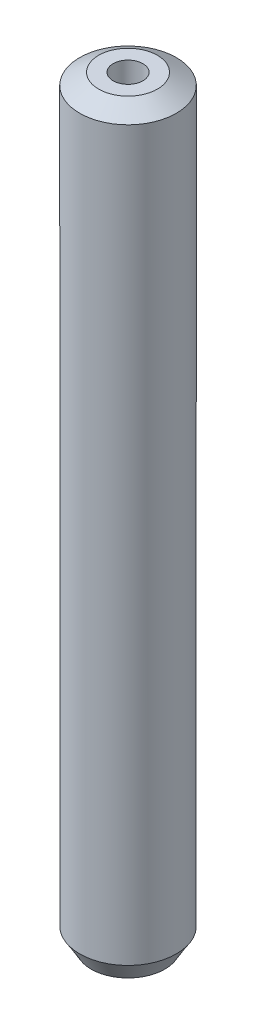
ISO-10303-21;
HEADER;
FILE_DESCRIPTION(('STEP AP214'),'2;1');
FILE_NAME('part.step','',(''),(''),'','','');
FILE_SCHEMA(('AUTOMOTIVE_DESIGN { 1 0 10303 214 1 1 1 1 }'));
ENDSEC;
DATA;
#1=APPLICATION_CONTEXT('core data for automotive mechanical design processes');
#2=APPLICATION_PROTOCOL_DEFINITION('international standard','automotive_design',2000,#1);
#3=PRODUCT_CONTEXT('',#1,'mechanical');
#4=PRODUCT('Part','Part','',(#3));
#5=PRODUCT_RELATED_PRODUCT_CATEGORY('part','',(#4));
#6=PRODUCT_DEFINITION_FORMATION('','',#4);
#7=PRODUCT_DEFINITION_CONTEXT('part definition',#1,'design');
#8=PRODUCT_DEFINITION('design','',#6,#7);
#9=PRODUCT_DEFINITION_SHAPE('','',#8);
#10=(LENGTH_UNIT() NAMED_UNIT(*) SI_UNIT(.MILLI.,.METRE.));
#11=(NAMED_UNIT(*) PLANE_ANGLE_UNIT() SI_UNIT($,.RADIAN.));
#12=(NAMED_UNIT(*) SI_UNIT($,.STERADIAN.) SOLID_ANGLE_UNIT());
#13=UNCERTAINTY_MEASURE_WITH_UNIT(LENGTH_MEASURE(1.E-05),#10,'distance_accuracy_value','');
#14=(GEOMETRIC_REPRESENTATION_CONTEXT(3) GLOBAL_UNCERTAINTY_ASSIGNED_CONTEXT((#13)) GLOBAL_UNIT_ASSIGNED_CONTEXT((#10,
#11,#12)) REPRESENTATION_CONTEXT('',''));
#15=CARTESIAN_POINT('',(0.,0.,0.));
#16=DIRECTION('',(0.,0.,1.));
#17=DIRECTION('',(1.,0.,0.));
#18=AXIS2_PLACEMENT_3D('',#15,#16,#17);
#19=CARTESIAN_POINT('',(0.,157.006909282694,0.));
#20=DIRECTION('',(0.,-1.,0.));
#21=DIRECTION('',(0.,0.,-1.));
#22=AXIS2_PLACEMENT_3D('',#19,#20,#21);
#23=CYLINDRICAL_SURFACE('',#22,10.);
#24=CARTESIAN_POINT('',(0.,154.643035266807,0.));
#25=DIRECTION('',(0.,1.,0.));
#26=DIRECTION('',(0.,0.,1.));
#27=AXIS2_PLACEMENT_3D('',#24,#25,#26);
#28=CIRCLE('',#27,10.);
#29=CARTESIAN_POINT('',(0.,154.643035266807,-10.));
#30=VERTEX_POINT('',#29);
#31=EDGE_CURVE('E50',#30,#30,#28,.F.);
#32=CARTESIAN_POINT('',(0.,3.92537237837895,0.));
#33=DIRECTION('',(0.,1.,0.));
#34=DIRECTION('',(0.,0.,1.));
#35=AXIS2_PLACEMENT_3D('',#32,#33,#34);
#36=CIRCLE('',#35,10.);
#37=CARTESIAN_POINT('',(0.,3.92537237837892,-10.));
#38=VERTEX_POINT('',#37);
#39=EDGE_CURVE('E51',#38,#38,#36,.T.);
#40=CARTESIAN_POINT('',(0.,154.643035266807,-10.));
#41=CARTESIAN_POINT('',(0.,153.073059611719,-10.));
#42=CARTESIAN_POINT('',(0.,151.503083956631,-10.));
#43=CARTESIAN_POINT('',(0.,148.363132646456,-10.));
#44=CARTESIAN_POINT('',(0.,146.793156991368,-10.));
#45=CARTESIAN_POINT('',(0.,143.653205681193,-10.));
#46=CARTESIAN_POINT('',(0.,142.083230026105,-10.));
#47=CARTESIAN_POINT('',(0.,138.943278715929,-10.));
#48=CARTESIAN_POINT('',(0.,137.373303060841,-10.));
#49=CARTESIAN_POINT('',(0.,134.233351750666,-10.));
#50=CARTESIAN_POINT('',(0.,132.663376095578,-10.));
#51=CARTESIAN_POINT('',(0.,129.523424785402,-10.));
#52=CARTESIAN_POINT('',(0.,127.953449130315,-10.));
#53=CARTESIAN_POINT('',(0.,124.813497820139,-10.));
#54=CARTESIAN_POINT('',(0.,123.243522165051,-10.));
#55=CARTESIAN_POINT('',(0.,120.103570854876,-10.));
#56=CARTESIAN_POINT('',(0.,118.533595199788,-10.));
#57=CARTESIAN_POINT('',(0.,115.393643889612,-10.));
#58=CARTESIAN_POINT('',(0.,113.823668234524,-10.));
#59=CARTESIAN_POINT('',(0.,110.683716924349,-10.));
#60=CARTESIAN_POINT('',(0.,109.113741269261,-10.));
#61=CARTESIAN_POINT('',(0.,105.973789959085,-10.));
#62=CARTESIAN_POINT('',(0.,104.403814303998,-10.));
#63=CARTESIAN_POINT('',(0.,101.263862993822,-10.));
#64=CARTESIAN_POINT('',(0.,99.6938873387343,-10.));
#65=CARTESIAN_POINT('',(0.,96.5539360285587,-10.));
#66=CARTESIAN_POINT('',(0.,94.9839603734709,-10.));
#67=CARTESIAN_POINT('',(0.,91.8440090632953,-10.));
#68=CARTESIAN_POINT('',(0.,90.2740334082075,-10.));
#69=CARTESIAN_POINT('',(0.,87.134082098032,-10.));
#70=CARTESIAN_POINT('',(0.,85.5641064429442,-10.));
#71=CARTESIAN_POINT('',(0.,82.4241551327686,-10.));
#72=CARTESIAN_POINT('',(0.,80.8541794776808,-10.));
#73=CARTESIAN_POINT('',(0.,77.7142281675052,-10.));
#74=CARTESIAN_POINT('',(0.,76.1442525124174,-10.));
#75=CARTESIAN_POINT('',(0.,73.0043012022418,-10.));
#76=CARTESIAN_POINT('',(0.,71.434325547154,-10.));
#77=CARTESIAN_POINT('',(0.,68.2943742369784,-10.));
#78=CARTESIAN_POINT('',(0.,66.7243985818906,-10.));
#79=CARTESIAN_POINT('',(0.,63.5844472717151,-10.));
#80=CARTESIAN_POINT('',(0.,62.0144716166273,-10.));
#81=CARTESIAN_POINT('',(0.,58.8745203064517,-10.));
#82=CARTESIAN_POINT('',(0.,57.3045446513639,-10.));
#83=CARTESIAN_POINT('',(0.,54.1645933411883,-10.));
#84=CARTESIAN_POINT('',(0.,52.5946176861005,-10.));
#85=CARTESIAN_POINT('',(0.,49.4546663759249,-10.));
#86=CARTESIAN_POINT('',(0.,47.8846907208371,-10.));
#87=CARTESIAN_POINT('',(0.,44.7447394106615,-10.));
#88=CARTESIAN_POINT('',(0.,43.1747637555737,-10.));
#89=CARTESIAN_POINT('',(0.,40.0348124453981,-10.));
#90=CARTESIAN_POINT('',(0.,38.4648367903104,-10.));
#91=CARTESIAN_POINT('',(0.,35.3248854801348,-10.));
#92=CARTESIAN_POINT('',(0.,33.754909825047,-10.));
#93=CARTESIAN_POINT('',(0.,30.6149585148714,-10.));
#94=CARTESIAN_POINT('',(0.,29.0449828597836,-10.));
#95=CARTESIAN_POINT('',(0.,25.905031549608,-10.));
#96=CARTESIAN_POINT('',(0.,24.3350558945202,-10.));
#97=CARTESIAN_POINT('',(0.,21.1951045843446,-10.));
#98=CARTESIAN_POINT('',(0.,19.6251289292568,-10.));
#99=CARTESIAN_POINT('',(0.,16.4851776190813,-10.));
#100=CARTESIAN_POINT('',(0.,14.9152019639935,-10.));
#101=CARTESIAN_POINT('',(0.,11.7752506538179,-10.));
#102=CARTESIAN_POINT('',(0.,10.2052749987301,-10.));
#103=CARTESIAN_POINT('',(0.,7.06532368855448,-10.));
#104=CARTESIAN_POINT('',(0.,5.4953480334667,-10.));
#105=CARTESIAN_POINT('',(0.,3.92537237837892,-10.));
#106=B_SPLINE_CURVE_WITH_KNOTS('',3,(#40,#41,#42,#43,#44,#45,#46,#47,#48,#49,#50,#51,#52,#53,
#54,#55,#56,#57,#58,#59,#60,#61,#62,#63,#64,#65,#66,#67,#68,#69,#70,#71,#72,#73,#74,#75,#76,#77,
#78,#79,#80,#81,#82,#83,#84,#85,#86,#87,#88,#89,#90,#91,#92,#93,#94,#95,#96,#97,#98,#99,#100,
#101,#102,#103,#104,#105),.UNSPECIFIED.,.F.,.F.,(4,2,2,2,2,2,2,2,2,2,2,2,2,2,2,2,2,2,2,2,2,2,2,
2,2,2,2,2,2,2,2,2,4),(0.,4.7099269652634,9.41985393052677,14.1297808957901,18.8397078610535,
23.5496348263169,28.2595617915803,32.9694887568437,37.6794157221071,42.3893426873704,
47.0992696526338,51.8091966178972,56.5191235831606,61.2290505484239,65.9389775136873,
70.6489044789507,75.3588314442141,80.0687584094775,84.7786853747409,89.4886123400042,
94.1985393052676,98.908466270531,103.618393235794,108.328320201058,113.038247166321,
117.748174131585,122.458101096848,127.168028062111,131.877955027375,136.587881992638,
141.297808957901,146.007735923165,150.717662888428),.UNSPECIFIED.);
#107=EDGE_CURVE('BSEAM39',#30,#38,#106,.T.);
#108=ORIENTED_EDGE('',*,*,#31,.T.);
#109=ORIENTED_EDGE('',*,*,#39,.T.);
#110=ORIENTED_EDGE('',*,*,#107,.T.);
#111=ORIENTED_EDGE('',*,*,#107,.F.);
#112=EDGE_LOOP('',(#108,#110,#109,#111));
#113=FACE_BOUND('',#112,.T.);
#114=ADVANCED_FACE('F39',(#113),#23,.T.);
#115=CARTESIAN_POINT('',(0.,157.006909282694,0.));
#116=DIRECTION('',(0.,1.,0.));
#117=DIRECTION('',(0.,0.,1.));
#118=AXIS2_PLACEMENT_3D('',#115,#116,#117);
#119=PLANE('',#118);
#120=CARTESIAN_POINT('',(0.,157.006909282694,0.));
#121=DIRECTION('',(0.,1.,0.));
#122=DIRECTION('',(0.,0.,1.));
#123=AXIS2_PLACEMENT_3D('',#120,#121,#122);
#124=CIRCLE('',#123,6.07462762162128);
#125=CARTESIAN_POINT('',(0.,157.006909282694,6.07462762162128));
#126=VERTEX_POINT('',#125);
#127=EDGE_CURVE('E54',#126,#126,#124,.T.);
#128=ORIENTED_EDGE('',*,*,#127,.T.);
#129=EDGE_LOOP('',(#128));
#130=FACE_BOUND('',#129,.T.);
#131=CARTESIAN_POINT('',(0.,157.006909282694,0.));
#132=DIRECTION('',(0.,1.,0.));
#133=DIRECTION('',(0.,0.,1.));
#134=AXIS2_PLACEMENT_3D('',#131,#132,#133);
#135=CIRCLE('',#134,3.08201990354724);
#136=CARTESIAN_POINT('',(0.,157.006909282694,-3.08201990354724));
#137=VERTEX_POINT('',#136);
#138=EDGE_CURVE('E58',#137,#137,#135,.T.);
#139=ORIENTED_EDGE('',*,*,#138,.F.);
#140=EDGE_LOOP('',(#139));
#141=FACE_BOUND('',#140,.T.);
#142=ADVANCED_FACE('F69',(#130,#141),#119,.T.);
#143=CARTESIAN_POINT('',(0.,0.,0.));
#144=DIRECTION('',(0.,1.,0.));
#145=DIRECTION('',(0.,0.,1.));
#146=AXIS2_PLACEMENT_3D('',#143,#144,#145);
#147=PLANE('',#146);
#148=CARTESIAN_POINT('',(0.,0.,0.));
#149=DIRECTION('',(0.,1.,0.));
#150=DIRECTION('',(0.,0.,1.));
#151=AXIS2_PLACEMENT_3D('',#148,#149,#150);
#152=CIRCLE('',#151,7.63612598411303);
#153=CARTESIAN_POINT('',(0.,0.,7.63612598411303));
#154=VERTEX_POINT('',#153);
#155=EDGE_CURVE('E10',#154,#154,#152,.F.);
#156=ORIENTED_EDGE('',*,*,#155,.T.);
#157=EDGE_LOOP('',(#156));
#158=FACE_BOUND('',#157,.T.);
#159=CARTESIAN_POINT('',(0.,0.,0.));
#160=DIRECTION('',(0.,1.,0.));
#161=DIRECTION('',(0.,0.,1.));
#162=AXIS2_PLACEMENT_3D('',#159,#160,#161);
#163=CIRCLE('',#162,3.08201990354724);
#164=CARTESIAN_POINT('',(0.,0.,-3.08201990354724));
#165=VERTEX_POINT('',#164);
#166=EDGE_CURVE('E63',#165,#165,#163,.T.);
#167=ORIENTED_EDGE('',*,*,#166,.T.);
#168=EDGE_LOOP('',(#167));
#169=FACE_BOUND('',#168,.T.);
#170=ADVANCED_FACE('F75',(#158,#169),#147,.F.);
#171=CARTESIAN_POINT('',(0.,157.006909282694,0.));
#172=DIRECTION('',(0.,-1.,0.));
#173=DIRECTION('',(0.,0.,-1.));
#174=AXIS2_PLACEMENT_3D('',#171,#172,#173);
#175=CYLINDRICAL_SURFACE('',#174,3.08201990354724);
#176=CARTESIAN_POINT('',(0.,157.006909282694,-3.08201990354724));
#177=CARTESIAN_POINT('',(0.,155.371420644333,-3.08201990354724));
#178=CARTESIAN_POINT('',(0.,153.735932005971,-3.08201990354724));
#179=CARTESIAN_POINT('',(0.,150.464954729248,-3.08201990354724));
#180=CARTESIAN_POINT('',(0.,148.829466090887,-3.08201990354724));
#181=CARTESIAN_POINT('',(0.,145.558488814164,-3.08201990354724));
#182=CARTESIAN_POINT('',(0.,143.923000175803,-3.08201990354724));
#183=CARTESIAN_POINT('',(0.,140.65202289908,-3.08201990354724));
#184=CARTESIAN_POINT('',(0.,139.016534260719,-3.08201990354724));
#185=CARTESIAN_POINT('',(0.,135.745556983996,-3.08201990354724));
#186=CARTESIAN_POINT('',(0.,134.110068345634,-3.08201990354724));
#187=CARTESIAN_POINT('',(0.,130.839091068912,-3.08201990354724));
#188=CARTESIAN_POINT('',(0.,129.20360243055,-3.08201990354724));
#189=CARTESIAN_POINT('',(0.,125.932625153827,-3.08201990354724));
#190=CARTESIAN_POINT('',(0.,124.297136515466,-3.08201990354724));
#191=CARTESIAN_POINT('',(0.,121.026159238743,-3.08201990354724));
#192=CARTESIAN_POINT('',(0.,119.390670600382,-3.08201990354724));
#193=CARTESIAN_POINT('',(0.,116.119693323659,-3.08201990354724));
#194=CARTESIAN_POINT('',(0.,114.484204685298,-3.08201990354724));
#195=CARTESIAN_POINT('',(0.,111.213227408575,-3.08201990354724));
#196=CARTESIAN_POINT('',(0.,109.577738770213,-3.08201990354724));
#197=CARTESIAN_POINT('',(0.,106.306761493491,-3.08201990354724));
#198=CARTESIAN_POINT('',(0.,104.671272855129,-3.08201990354724));
#199=CARTESIAN_POINT('',(0.,101.400295578406,-3.08201990354724));
#200=CARTESIAN_POINT('',(0.,99.7648069400451,-3.08201990354724));
#201=CARTESIAN_POINT('',(0.,96.4938296633223,-3.08201990354724));
#202=CARTESIAN_POINT('',(0.,94.8583410249609,-3.08201990354724));
#203=CARTESIAN_POINT('',(0.,91.5873637482381,-3.08201990354724));
#204=CARTESIAN_POINT('',(0.,89.9518751098767,-3.08201990354724));
#205=CARTESIAN_POINT('',(0.,86.6808978331539,-3.08201990354724));
#206=CARTESIAN_POINT('',(0.,85.0454091947925,-3.08201990354724));
#207=CARTESIAN_POINT('',(0.,81.7744319180698,-3.08201990354724));
#208=CARTESIAN_POINT('',(0.,80.1389432797084,-3.08201990354724));
#209=CARTESIAN_POINT('',(0.,76.8679660029856,-3.08201990354724));
#210=CARTESIAN_POINT('',(0.,75.2324773646242,-3.08201990354724));
#211=CARTESIAN_POINT('',(0.,71.9615000879014,-3.08201990354724));
#212=CARTESIAN_POINT('',(0.,70.32601144954,-3.08201990354724));
#213=CARTESIAN_POINT('',(0.,67.0550341728172,-3.08201990354724));
#214=CARTESIAN_POINT('',(0.,65.4195455344558,-3.08201990354724));
#215=CARTESIAN_POINT('',(0.,62.148568257733,-3.08201990354724));
#216=CARTESIAN_POINT('',(0.,60.5130796193716,-3.08201990354724));
#217=CARTESIAN_POINT('',(0.,57.2421023426488,-3.08201990354724));
#218=CARTESIAN_POINT('',(0.,55.6066137042874,-3.08201990354724));
#219=CARTESIAN_POINT('',(0.,52.3356364275646,-3.08201990354724));
#220=CARTESIAN_POINT('',(0.,50.7001477892032,-3.08201990354724));
#221=CARTESIAN_POINT('',(0.,47.4291705124805,-3.08201990354724));
#222=CARTESIAN_POINT('',(0.,45.7936818741191,-3.08201990354724));
#223=CARTESIAN_POINT('',(0.,42.5227045973963,-3.08201990354724));
#224=CARTESIAN_POINT('',(0.,40.8872159590349,-3.08201990354724));
#225=CARTESIAN_POINT('',(0.,37.6162386823121,-3.08201990354724));
#226=CARTESIAN_POINT('',(0.,35.9807500439507,-3.08201990354724));
#227=CARTESIAN_POINT('',(0.,32.7097727672279,-3.08201990354724));
#228=CARTESIAN_POINT('',(0.,31.0742841288665,-3.08201990354724));
#229=CARTESIAN_POINT('',(0.,27.8033068521437,-3.08201990354724));
#230=CARTESIAN_POINT('',(0.,26.1678182137823,-3.08201990354724));
#231=CARTESIAN_POINT('',(0.,22.8968409370595,-3.08201990354724));
#232=CARTESIAN_POINT('',(0.,21.2613522986981,-3.08201990354724));
#233=CARTESIAN_POINT('',(0.,17.9903750219753,-3.08201990354724));
#234=CARTESIAN_POINT('',(0.,16.3548863836139,-3.08201990354724));
#235=CARTESIAN_POINT('',(0.,13.0839091068912,-3.08201990354724));
#236=CARTESIAN_POINT('',(0.,11.4484204685298,-3.08201990354724));
#237=CARTESIAN_POINT('',(0.,8.17744319180697,-3.08201990354724));
#238=CARTESIAN_POINT('',(0.,6.54195455344557,-3.08201990354724));
#239=CARTESIAN_POINT('',(0.,3.27097727672278,-3.08201990354724));
#240=CARTESIAN_POINT('',(0.,1.63548863836139,-3.08201990354724));
#241=CARTESIAN_POINT('',(0.,0.,-3.08201990354724));
#242=B_SPLINE_CURVE_WITH_KNOTS('',3,(#176,#177,#178,#179,#180,#181,#182,#183,#184,#185,#186,
#187,#188,#189,#190,#191,#192,#193,#194,#195,#196,#197,#198,#199,#200,#201,#202,#203,#204,#205,
#206,#207,#208,#209,#210,#211,#212,#213,#214,#215,#216,#217,#218,#219,#220,#221,#222,#223,#224,
#225,#226,#227,#228,#229,#230,#231,#232,#233,#234,#235,#236,#237,#238,#239,#240,#241),
.UNSPECIFIED.,.F.,.F.,(4,2,2,2,2,2,2,2,2,2,2,2,2,2,2,2,2,2,2,2,2,2,2,2,2,2,2,2,2,2,2,2,4),(0.,
4.90646591508417,9.81293183016835,14.7193977452526,19.6258636603367,24.5323295754209,
29.4387954905051,34.3452614055893,39.2517273206735,44.1581932357577,49.0646591508418,
53.971125065926,58.8775909810102,63.7840568960944,68.6905228111786,73.5969887262628,
78.5034546413469,83.4099205564311,88.3163864715153,93.2228523865995,98.1293183016837,
103.035784216768,107.942250131852,112.848716046936,117.75518196202,122.661647877105,
127.568113792189,132.474579707273,137.381045622357,142.287511537441,147.193977452526,
152.10044336761,157.006909282694),.UNSPECIFIED.);
#243=EDGE_CURVE('BSEAM70',#137,#165,#242,.T.);
#244=ORIENTED_EDGE('',*,*,#138,.T.);
#245=ORIENTED_EDGE('',*,*,#166,.F.);
#246=ORIENTED_EDGE('',*,*,#243,.T.);
#247=ORIENTED_EDGE('',*,*,#243,.F.);
#248=EDGE_LOOP('',(#244,#246,#245,#247));
#249=FACE_BOUND('',#248,.T.);
#250=ADVANCED_FACE('F70',(#249),#175,.F.);
#251=CARTESIAN_POINT('',(0.,157.006909282694,0.));
#252=DIRECTION('',(0.,-1.,0.));
#253=DIRECTION('',(0.,0.,-1.));
#254=AXIS2_PLACEMENT_3D('',#251,#252,#253);
#255=CONICAL_SURFACE('',#254,6.07462762162128,1.02875798817209);
#256=ORIENTED_EDGE('',*,*,#31,.F.);
#257=EDGE_LOOP('',(#256));
#258=FACE_BOUND('',#257,.T.);
#259=ORIENTED_EDGE('',*,*,#127,.F.);
#260=EDGE_LOOP('',(#259));
#261=FACE_BOUND('',#260,.T.);
#262=ADVANCED_FACE('F81',(#258,#261),#255,.T.);
#263=CARTESIAN_POINT('',(0.,3.92537237837895,0.));
#264=DIRECTION('',(0.,1.,0.));
#265=DIRECTION('',(0.,0.,1.));
#266=AXIS2_PLACEMENT_3D('',#263,#264,#265);
#267=CONICAL_SURFACE('',#266,10.,0.542038338622805);
#268=ORIENTED_EDGE('',*,*,#155,.F.);
#269=EDGE_LOOP('',(#268));
#270=FACE_BOUND('',#269,.T.);
#271=ORIENTED_EDGE('',*,*,#39,.F.);
#272=EDGE_LOOP('',(#271));
#273=FACE_BOUND('',#272,.T.);
#274=ADVANCED_FACE('F45',(#270,#273),#267,.T.);
#275=CLOSED_SHELL('',(#114,#142,#170,#250,#262,#274));
#276=MANIFOLD_SOLID_BREP('B2',#275);
#277=ADVANCED_BREP_SHAPE_REPRESENTATION('',(#18,#276),#14);
#278=SHAPE_DEFINITION_REPRESENTATION(#9,#277);
ENDSEC;
END-ISO-10303-21;
